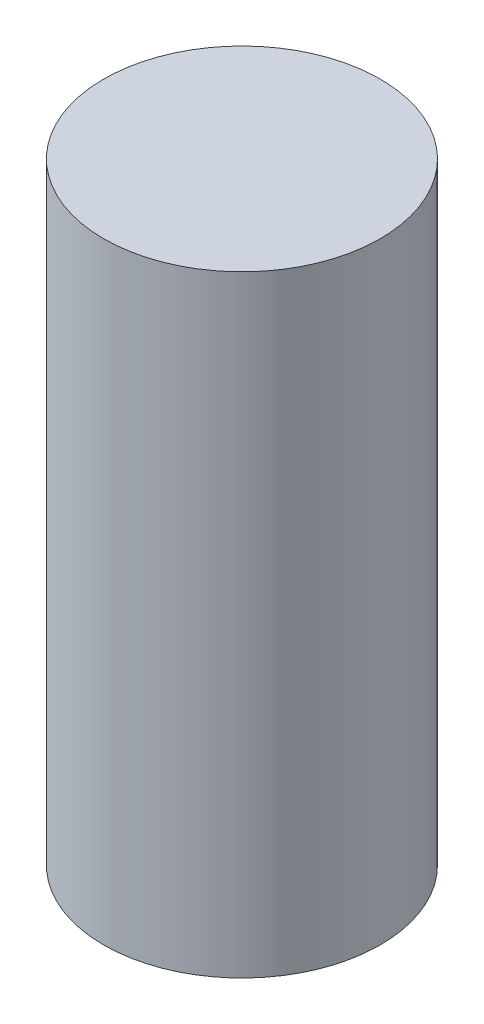
ISO-10303-21;
HEADER;
FILE_DESCRIPTION(('STEP AP214'),'2;1');
FILE_NAME('part.step','',(''),(''),'','','');
FILE_SCHEMA(('AUTOMOTIVE_DESIGN { 1 0 10303 214 1 1 1 1 }'));
ENDSEC;
DATA;
#1=APPLICATION_CONTEXT('core data for automotive mechanical design processes');
#2=APPLICATION_PROTOCOL_DEFINITION('international standard','automotive_design',2000,#1);
#3=PRODUCT_CONTEXT('',#1,'mechanical');
#4=PRODUCT('Part','Part','',(#3));
#5=PRODUCT_RELATED_PRODUCT_CATEGORY('part','',(#4));
#6=PRODUCT_DEFINITION_FORMATION('','',#4);
#7=PRODUCT_DEFINITION_CONTEXT('part definition',#1,'design');
#8=PRODUCT_DEFINITION('design','',#6,#7);
#9=PRODUCT_DEFINITION_SHAPE('','',#8);
#10=(LENGTH_UNIT() NAMED_UNIT(*) SI_UNIT(.MILLI.,.METRE.));
#11=(NAMED_UNIT(*) PLANE_ANGLE_UNIT() SI_UNIT($,.RADIAN.));
#12=(NAMED_UNIT(*) SI_UNIT($,.STERADIAN.) SOLID_ANGLE_UNIT());
#13=UNCERTAINTY_MEASURE_WITH_UNIT(LENGTH_MEASURE(1.E-05),#10,'distance_accuracy_value','');
#14=(GEOMETRIC_REPRESENTATION_CONTEXT(3) GLOBAL_UNCERTAINTY_ASSIGNED_CONTEXT((#13)) GLOBAL_UNIT_ASSIGNED_CONTEXT((#10,
#11,#12)) REPRESENTATION_CONTEXT('',''));
#15=CARTESIAN_POINT('',(0.,0.,0.));
#16=DIRECTION('',(0.,0.,1.));
#17=DIRECTION('',(1.,0.,0.));
#18=AXIS2_PLACEMENT_3D('',#15,#16,#17);
#19=CARTESIAN_POINT('',(0.,11.5,0.));
#20=DIRECTION('',(0.,-1.,0.));
#21=DIRECTION('',(0.,0.,-1.));
#22=AXIS2_PLACEMENT_3D('',#19,#20,#21);
#23=CYLINDRICAL_SURFACE('',#22,2.6);
#24=CARTESIAN_POINT('',(0.,11.5,0.));
#25=DIRECTION('',(0.,1.,0.));
#26=DIRECTION('',(0.,0.,1.));
#27=AXIS2_PLACEMENT_3D('',#24,#25,#26);
#28=CIRCLE('',#27,2.6);
#29=CARTESIAN_POINT('',(0.,11.5,2.6));
#30=VERTEX_POINT('',#29);
#31=EDGE_CURVE('E10',#30,#30,#28,.T.);
#32=ORIENTED_EDGE('',*,*,#31,.F.);
#33=EDGE_LOOP('',(#32));
#34=FACE_BOUND('',#33,.T.);
#35=CARTESIAN_POINT('',(0.,0.,0.));
#36=DIRECTION('',(0.,1.,0.));
#37=DIRECTION('',(0.,0.,1.));
#38=AXIS2_PLACEMENT_3D('',#35,#36,#37);
#39=CIRCLE('',#38,2.6);
#40=CARTESIAN_POINT('',(0.,0.,2.6));
#41=VERTEX_POINT('',#40);
#42=EDGE_CURVE('E39',#41,#41,#39,.T.);
#43=ORIENTED_EDGE('',*,*,#42,.T.);
#44=EDGE_LOOP('',(#43));
#45=FACE_BOUND('',#44,.T.);
#46=ADVANCED_FACE('F36',(#34,#45),#23,.T.);
#47=CARTESIAN_POINT('',(0.,11.5,0.));
#48=DIRECTION('',(0.,1.,0.));
#49=DIRECTION('',(0.,0.,1.));
#50=AXIS2_PLACEMENT_3D('',#47,#48,#49);
#51=PLANE('',#50);
#52=ORIENTED_EDGE('',*,*,#31,.T.);
#53=EDGE_LOOP('',(#52));
#54=FACE_BOUND('',#53,.T.);
#55=ADVANCED_FACE('F51',(#54),#51,.T.);
#56=CARTESIAN_POINT('',(0.,0.,0.));
#57=DIRECTION('',(0.,1.,0.));
#58=DIRECTION('',(0.,0.,1.));
#59=AXIS2_PLACEMENT_3D('',#56,#57,#58);
#60=PLANE('',#59);
#61=ORIENTED_EDGE('',*,*,#42,.F.);
#62=EDGE_LOOP('',(#61));
#63=FACE_BOUND('',#62,.T.);
#64=ADVANCED_FACE('F49',(#63),#60,.F.);
#65=CLOSED_SHELL('',(#46,#55,#64));
#66=MANIFOLD_SOLID_BREP('B2',#65);
#67=ADVANCED_BREP_SHAPE_REPRESENTATION('',(#18,#66),#14);
#68=SHAPE_DEFINITION_REPRESENTATION(#9,#67);
ENDSEC;
END-ISO-10303-21;
